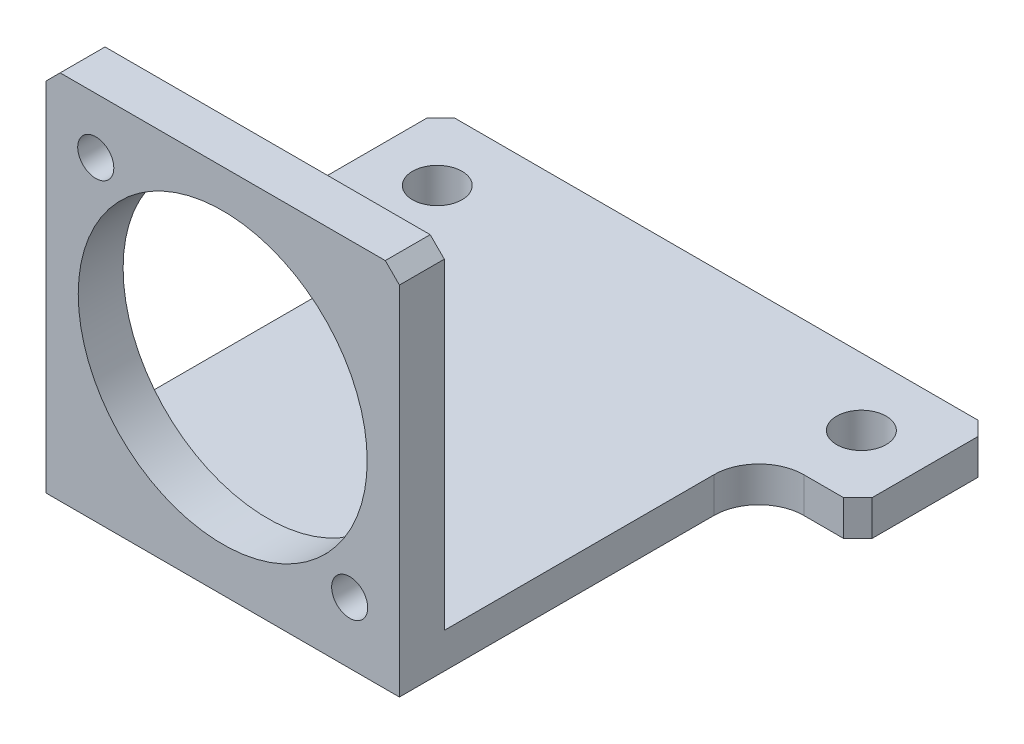
ISO-10303-21;
HEADER;
FILE_DESCRIPTION(('STEP AP214'),'2;1');
FILE_NAME('part.step','',(''),(''),'','','');
FILE_SCHEMA(('AUTOMOTIVE_DESIGN { 1 0 10303 214 1 1 1 1 }'));
ENDSEC;
DATA;
#1=APPLICATION_CONTEXT('core data for automotive mechanical design processes');
#2=APPLICATION_PROTOCOL_DEFINITION('international standard','automotive_design',2000,#1);
#3=PRODUCT_CONTEXT('',#1,'mechanical');
#4=PRODUCT('Part','Part','',(#3));
#5=PRODUCT_RELATED_PRODUCT_CATEGORY('part','',(#4));
#6=PRODUCT_DEFINITION_FORMATION('','',#4);
#7=PRODUCT_DEFINITION_CONTEXT('part definition',#1,'design');
#8=PRODUCT_DEFINITION('design','',#6,#7);
#9=PRODUCT_DEFINITION_SHAPE('','',#8);
#10=(LENGTH_UNIT() NAMED_UNIT(*) SI_UNIT(.MILLI.,.METRE.));
#11=(NAMED_UNIT(*) PLANE_ANGLE_UNIT() SI_UNIT($,.RADIAN.));
#12=(NAMED_UNIT(*) SI_UNIT($,.STERADIAN.) SOLID_ANGLE_UNIT());
#13=UNCERTAINTY_MEASURE_WITH_UNIT(LENGTH_MEASURE(1.E-05),#10,'distance_accuracy_value','');
#14=(GEOMETRIC_REPRESENTATION_CONTEXT(3) GLOBAL_UNCERTAINTY_ASSIGNED_CONTEXT((#13)) GLOBAL_UNIT_ASSIGNED_CONTEXT((#10,
#11,#12)) REPRESENTATION_CONTEXT('',''));
#15=CARTESIAN_POINT('',(0.,0.,0.));
#16=DIRECTION('',(0.,0.,1.));
#17=DIRECTION('',(1.,0.,0.));
#18=AXIS2_PLACEMENT_3D('',#15,#16,#17);
#19=CARTESIAN_POINT('',(0.,0.,6.35));
#20=DIRECTION('',(0.,0.,-1.));
#21=DIRECTION('',(-1.,0.,0.));
#22=AXIS2_PLACEMENT_3D('',#19,#20,#21);
#23=PLANE('',#22);
#24=CARTESIAN_POINT('',(-17.9605122421382,18.3755122421384,6.35));
#25=DIRECTION('',(0.,0.,1.));
#26=DIRECTION('',(1.,0.,0.));
#27=AXIS2_PLACEMENT_3D('',#24,#25,#26);
#28=CIRCLE('',#27,2.5527);
#29=CARTESIAN_POINT('',(-15.4078122421382,18.3755122421384,6.35));
#30=VERTEX_POINT('',#29);
#31=EDGE_CURVE('E429',#30,#30,#28,.T.);
#32=ORIENTED_EDGE('',*,*,#31,.F.);
#33=EDGE_LOOP('',(#32));
#34=FACE_BOUND('',#33,.T.);
#35=CARTESIAN_POINT('',(17.9605122421382,-17.5455122421384,6.35));
#36=DIRECTION('',(0.,0.,1.));
#37=DIRECTION('',(1.,0.,0.));
#38=AXIS2_PLACEMENT_3D('',#35,#36,#37);
#39=CIRCLE('',#38,2.5527);
#40=CARTESIAN_POINT('',(20.5132122421382,-17.5455122421384,6.35));
#41=VERTEX_POINT('',#40);
#42=EDGE_CURVE('E423',#41,#41,#39,.T.);
#43=ORIENTED_EDGE('',*,*,#42,.F.);
#44=EDGE_LOOP('',(#43));
#45=FACE_BOUND('',#44,.T.);
#46=DIRECTION('',(0.,1.,0.));
#47=VECTOR('',#46,1.);
#48=CARTESIAN_POINT('',(25.,-26.24,6.35));
#49=LINE('',#48,#47);
#50=CARTESIAN_POINT('',(25.,-26.24,6.35));
#51=VERTEX_POINT('',#50);
#52=CARTESIAN_POINT('',(25.,24.24,6.35));
#53=VERTEX_POINT('',#52);
#54=EDGE_CURVE('E237',#51,#53,#49,.T.);
#55=ORIENTED_EDGE('',*,*,#54,.T.);
#56=DIRECTION('',(0.707106781186548,-0.707106781186548,0.));
#57=VECTOR('',#56,1.);
#58=CARTESIAN_POINT('',(23.,26.24,6.35));
#59=LINE('',#58,#57);
#60=CARTESIAN_POINT('',(23.,26.24,6.35));
#61=VERTEX_POINT('',#60);
#62=EDGE_CURVE('E52',#53,#61,#59,.F.);
#63=ORIENTED_EDGE('',*,*,#62,.T.);
#64=DIRECTION('',(-1.,0.,0.));
#65=VECTOR('',#64,1.);
#66=CARTESIAN_POINT('',(-25.,26.24,6.35));
#67=LINE('',#66,#65);
#68=CARTESIAN_POINT('',(-23.,26.24,6.35));
#69=VERTEX_POINT('',#68);
#70=EDGE_CURVE('E239',#61,#69,#67,.T.);
#71=ORIENTED_EDGE('',*,*,#70,.T.);
#72=DIRECTION('',(0.707106781186548,0.707106781186548,0.));
#73=VECTOR('',#72,1.);
#74=CARTESIAN_POINT('',(-25.,24.24,6.35));
#75=LINE('',#74,#73);
#76=CARTESIAN_POINT('',(-25.,24.24,6.35));
#77=VERTEX_POINT('',#76);
#78=EDGE_CURVE('E59',#69,#77,#75,.F.);
#79=ORIENTED_EDGE('',*,*,#78,.T.);
#80=DIRECTION('',(0.,-1.,0.));
#81=VECTOR('',#80,1.);
#82=CARTESIAN_POINT('',(-25.,-26.24,6.35));
#83=LINE('',#82,#81);
#84=CARTESIAN_POINT('',(-25.,-26.24,6.35));
#85=VERTEX_POINT('',#84);
#86=EDGE_CURVE('E242',#77,#85,#83,.T.);
#87=ORIENTED_EDGE('',*,*,#86,.T.);
#88=DIRECTION('',(1.,0.,0.));
#89=VECTOR('',#88,1.);
#90=CARTESIAN_POINT('',(-25.,-26.24,6.35));
#91=LINE('',#90,#89);
#92=EDGE_CURVE('E244',#85,#51,#91,.T.);
#93=ORIENTED_EDGE('',*,*,#92,.T.);
#94=EDGE_LOOP('',(#55,#63,#71,#79,#87,#93));
#95=FACE_BOUND('',#94,.T.);
#96=CARTESIAN_POINT('',(0.,0.415000000000002,6.35));
#97=DIRECTION('',(0.,0.,1.));
#98=DIRECTION('',(1.,0.,0.));
#99=AXIS2_PLACEMENT_3D('',#96,#97,#98);
#100=CIRCLE('',#99,20.44);
#101=CARTESIAN_POINT('',(20.44,0.415000000000002,6.35));
#102=VERTEX_POINT('',#101);
#103=EDGE_CURVE('E181',#102,#102,#100,.T.);
#104=ORIENTED_EDGE('',*,*,#103,.F.);
#105=EDGE_LOOP('',(#104));
#106=FACE_BOUND('',#105,.T.);
#107=ADVANCED_FACE('F43',(#34,#45,#95,#106),#23,.F.);
#108=CARTESIAN_POINT('',(0.,0.,0.));
#109=DIRECTION('',(0.,0.,-1.));
#110=DIRECTION('',(-1.,0.,0.));
#111=AXIS2_PLACEMENT_3D('',#108,#109,#110);
#112=PLANE('',#111);
#113=CARTESIAN_POINT('',(-17.9605122421382,18.3755122421384,0.));
#114=DIRECTION('',(0.,0.,-1.));
#115=DIRECTION('',(-1.,0.,0.));
#116=AXIS2_PLACEMENT_3D('',#113,#114,#115);
#117=CIRCLE('',#116,2.5527);
#118=CARTESIAN_POINT('',(-20.5132122421382,18.3755122421384,0.));
#119=VERTEX_POINT('',#118);
#120=EDGE_CURVE('E426',#119,#119,#117,.T.);
#121=ORIENTED_EDGE('',*,*,#120,.F.);
#122=EDGE_LOOP('',(#121));
#123=FACE_BOUND('',#122,.T.);
#124=CARTESIAN_POINT('',(17.9605122421382,-17.5455122421384,0.));
#125=DIRECTION('',(0.,0.,-1.));
#126=DIRECTION('',(-1.,0.,0.));
#127=AXIS2_PLACEMENT_3D('',#124,#125,#126);
#128=CIRCLE('',#127,2.5527);
#129=CARTESIAN_POINT('',(15.4078122421382,-17.5455122421384,0.));
#130=VERTEX_POINT('',#129);
#131=EDGE_CURVE('E215',#130,#130,#128,.T.);
#132=ORIENTED_EDGE('',*,*,#131,.F.);
#133=EDGE_LOOP('',(#132));
#134=FACE_BOUND('',#133,.T.);
#135=DIRECTION('',(-1.,0.,0.));
#136=VECTOR('',#135,1.);
#137=CARTESIAN_POINT('',(-25.,26.24,0.));
#138=LINE('',#137,#136);
#139=CARTESIAN_POINT('',(23.,26.24,0.));
#140=VERTEX_POINT('',#139);
#141=CARTESIAN_POINT('',(-23.,26.24,0.));
#142=VERTEX_POINT('',#141);
#143=EDGE_CURVE('E180',#140,#142,#138,.T.);
#144=ORIENTED_EDGE('',*,*,#143,.F.);
#145=DIRECTION('',(-0.707106781186548,0.707106781186548,0.));
#146=VECTOR('',#145,1.);
#147=CARTESIAN_POINT('',(24.62,24.62,0.));
#148=LINE('',#147,#146);
#149=CARTESIAN_POINT('',(25.,24.24,0.));
#150=VERTEX_POINT('',#149);
#151=EDGE_CURVE('E178',#140,#150,#148,.F.);
#152=ORIENTED_EDGE('',*,*,#151,.T.);
#153=DIRECTION('',(0.,1.,0.));
#154=VECTOR('',#153,1.);
#155=CARTESIAN_POINT('',(25.,-26.24,0.));
#156=LINE('',#155,#154);
#157=CARTESIAN_POINT('',(25.,-21.24,0.));
#158=VERTEX_POINT('',#157);
#159=EDGE_CURVE('E171',#158,#150,#156,.T.);
#160=ORIENTED_EDGE('',*,*,#159,.F.);
#161=DIRECTION('',(1.,0.,0.));
#162=VECTOR('',#161,1.);
#163=CARTESIAN_POINT('',(0.,-21.24,0.));
#164=LINE('',#163,#162);
#165=CARTESIAN_POINT('',(-25.,-21.24,0.));
#166=VERTEX_POINT('',#165);
#167=EDGE_CURVE('E177',#166,#158,#164,.T.);
#168=ORIENTED_EDGE('',*,*,#167,.F.);
#169=DIRECTION('',(0.,-1.,0.));
#170=VECTOR('',#169,1.);
#171=CARTESIAN_POINT('',(-25.,-26.24,0.));
#172=LINE('',#171,#170);
#173=CARTESIAN_POINT('',(-25.,24.24,0.));
#174=VERTEX_POINT('',#173);
#175=EDGE_CURVE('E240',#174,#166,#172,.T.);
#176=ORIENTED_EDGE('',*,*,#175,.F.);
#177=DIRECTION('',(-0.707106781186548,-0.707106781186548,0.));
#178=VECTOR('',#177,1.);
#179=CARTESIAN_POINT('',(-24.62,24.62,0.));
#180=LINE('',#179,#178);
#181=EDGE_CURVE('E314',#174,#142,#180,.F.);
#182=ORIENTED_EDGE('',*,*,#181,.T.);
#183=EDGE_LOOP('',(#144,#152,#160,#168,#176,#182));
#184=FACE_BOUND('',#183,.T.);
#185=CARTESIAN_POINT('',(0.,0.415000000000002,0.));
#186=DIRECTION('',(0.,0.,1.));
#187=DIRECTION('',(1.,0.,0.));
#188=AXIS2_PLACEMENT_3D('',#185,#186,#187);
#189=CIRCLE('',#188,20.44);
#190=CARTESIAN_POINT('',(20.44,0.415000000000002,0.));
#191=VERTEX_POINT('',#190);
#192=EDGE_CURVE('E211',#191,#191,#189,.T.);
#193=ORIENTED_EDGE('',*,*,#192,.T.);
#194=EDGE_LOOP('',(#193));
#195=FACE_BOUND('',#194,.T.);
#196=ADVANCED_FACE('F174',(#123,#134,#184,#195),#112,.T.);
#197=CARTESIAN_POINT('',(25.,-26.24,6.35));
#198=DIRECTION('',(-1.,0.,0.));
#199=DIRECTION('',(0.,0.,1.));
#200=AXIS2_PLACEMENT_3D('',#197,#198,#199);
#201=PLANE('',#200);
#202=ORIENTED_EDGE('',*,*,#159,.T.);
#203=DIRECTION('',(0.,0.,1.));
#204=VECTOR('',#203,1.);
#205=CARTESIAN_POINT('',(25.,24.24,6.35));
#206=LINE('',#205,#204);
#207=EDGE_CURVE('E67',#150,#53,#206,.T.);
#208=ORIENTED_EDGE('',*,*,#207,.T.);
#209=ORIENTED_EDGE('',*,*,#54,.F.);
#210=DIRECTION('',(0.,0.,-1.));
#211=VECTOR('',#210,1.);
#212=CARTESIAN_POINT('',(25.,-26.24,6.35));
#213=LINE('',#212,#211);
#214=CARTESIAN_POINT('',(25.,-26.24,-38.15));
#215=VERTEX_POINT('',#214);
#216=EDGE_CURVE('E245',#51,#215,#213,.T.);
#217=ORIENTED_EDGE('',*,*,#216,.T.);
#218=DIRECTION('',(0.,-1.,0.));
#219=VECTOR('',#218,1.);
#220=CARTESIAN_POINT('',(25.,-21.24,-38.15));
#221=LINE('',#220,#219);
#222=CARTESIAN_POINT('',(25.,-21.24,-38.15));
#223=VERTEX_POINT('',#222);
#224=EDGE_CURVE('E198',#215,#223,#221,.F.);
#225=ORIENTED_EDGE('',*,*,#224,.T.);
#226=DIRECTION('',(0.,0.,-1.));
#227=VECTOR('',#226,1.);
#228=CARTESIAN_POINT('',(25.,-21.24,0.));
#229=LINE('',#228,#227);
#230=EDGE_CURVE('E189',#158,#223,#229,.T.);
#231=ORIENTED_EDGE('',*,*,#230,.F.);
#232=EDGE_LOOP('',(#202,#208,#209,#217,#225,#231));
#233=FACE_BOUND('',#232,.T.);
#234=ADVANCED_FACE('F195',(#233),#201,.F.);
#235=CARTESIAN_POINT('',(-25.,26.24,6.35));
#236=DIRECTION('',(0.,-1.,0.));
#237=DIRECTION('',(0.,0.,-1.));
#238=AXIS2_PLACEMENT_3D('',#235,#236,#237);
#239=PLANE('',#238);
#240=ORIENTED_EDGE('',*,*,#70,.F.);
#241=DIRECTION('',(0.,0.,-1.));
#242=VECTOR('',#241,1.);
#243=CARTESIAN_POINT('',(23.,26.24,6.35));
#244=LINE('',#243,#242);
#245=EDGE_CURVE('E311',#61,#140,#244,.T.);
#246=ORIENTED_EDGE('',*,*,#245,.T.);
#247=ORIENTED_EDGE('',*,*,#143,.T.);
#248=DIRECTION('',(0.,0.,1.));
#249=VECTOR('',#248,1.);
#250=CARTESIAN_POINT('',(-23.,26.24,6.35));
#251=LINE('',#250,#249);
#252=EDGE_CURVE('E309',#142,#69,#251,.T.);
#253=ORIENTED_EDGE('',*,*,#252,.T.);
#254=EDGE_LOOP('',(#240,#246,#247,#253));
#255=FACE_BOUND('',#254,.T.);
#256=ADVANCED_FACE('F324',(#255),#239,.F.);
#257=CARTESIAN_POINT('',(-25.,-26.24,6.35));
#258=DIRECTION('',(1.,0.,0.));
#259=DIRECTION('',(0.,0.,-1.));
#260=AXIS2_PLACEMENT_3D('',#257,#258,#259);
#261=PLANE('',#260);
#262=ORIENTED_EDGE('',*,*,#86,.F.);
#263=DIRECTION('',(0.,0.,-1.));
#264=VECTOR('',#263,1.);
#265=CARTESIAN_POINT('',(-25.,24.24,6.35));
#266=LINE('',#265,#264);
#267=EDGE_CURVE('E11',#77,#174,#266,.T.);
#268=ORIENTED_EDGE('',*,*,#267,.T.);
#269=ORIENTED_EDGE('',*,*,#175,.T.);
#270=DIRECTION('',(0.,0.,1.));
#271=VECTOR('',#270,1.);
#272=CARTESIAN_POINT('',(-25.,-21.24,0.));
#273=LINE('',#272,#271);
#274=CARTESIAN_POINT('',(-25.,-21.24,-38.15));
#275=VERTEX_POINT('',#274);
#276=EDGE_CURVE('E192',#275,#166,#273,.T.);
#277=ORIENTED_EDGE('',*,*,#276,.F.);
#278=DIRECTION('',(0.,-1.,0.));
#279=VECTOR('',#278,1.);
#280=CARTESIAN_POINT('',(-25.,-26.24,-38.15));
#281=LINE('',#280,#279);
#282=CARTESIAN_POINT('',(-25.,-26.24,-38.15));
#283=VERTEX_POINT('',#282);
#284=EDGE_CURVE('E258',#275,#283,#281,.T.);
#285=ORIENTED_EDGE('',*,*,#284,.T.);
#286=DIRECTION('',(0.,0.,-1.));
#287=VECTOR('',#286,1.);
#288=CARTESIAN_POINT('',(-25.,-26.24,6.35));
#289=LINE('',#288,#287);
#290=EDGE_CURVE('E251',#85,#283,#289,.T.);
#291=ORIENTED_EDGE('',*,*,#290,.F.);
#292=EDGE_LOOP('',(#262,#268,#269,#277,#285,#291));
#293=FACE_BOUND('',#292,.T.);
#294=ADVANCED_FACE('F355',(#293),#261,.F.);
#295=CARTESIAN_POINT('',(-25.,-26.24,6.35));
#296=DIRECTION('',(0.,1.,0.));
#297=DIRECTION('',(0.,0.,1.));
#298=AXIS2_PLACEMENT_3D('',#295,#296,#297);
#299=PLANE('',#298);
#300=DIRECTION('',(0.,0.,1.));
#301=VECTOR('',#300,1.);
#302=CARTESIAN_POINT('',(-39.,-26.24,0.));
#303=LINE('',#302,#301);
#304=CARTESIAN_POINT('',(-39.,-26.24,-61.5));
#305=VERTEX_POINT('',#304);
#306=CARTESIAN_POINT('',(-39.,-26.24,-46.5));
#307=VERTEX_POINT('',#306);
#308=EDGE_CURVE('E214',#305,#307,#303,.T.);
#309=ORIENTED_EDGE('',*,*,#308,.F.);
#310=DIRECTION('',(-0.70710678118655,0.,0.707106781186545));
#311=VECTOR('',#310,1.);
#312=CARTESIAN_POINT('',(-39.,-26.24,-61.5));
#313=LINE('',#312,#311);
#314=CARTESIAN_POINT('',(-37.,-26.24,-63.5));
#315=VERTEX_POINT('',#314);
#316=EDGE_CURVE('E284',#305,#315,#313,.F.);
#317=ORIENTED_EDGE('',*,*,#316,.T.);
#318=DIRECTION('',(-1.,0.,0.));
#319=VECTOR('',#318,1.);
#320=CARTESIAN_POINT('',(0.,-26.24,-63.5));
#321=LINE('',#320,#319);
#322=CARTESIAN_POINT('',(37.,-26.24,-63.5));
#323=VERTEX_POINT('',#322);
#324=EDGE_CURVE('E218',#323,#315,#321,.T.);
#325=ORIENTED_EDGE('',*,*,#324,.F.);
#326=DIRECTION('',(-0.707106781186548,0.,-0.707106781186548));
#327=VECTOR('',#326,1.);
#328=CARTESIAN_POINT('',(37.,-26.24,-63.5));
#329=LINE('',#328,#327);
#330=CARTESIAN_POINT('',(39.,-26.24,-61.5));
#331=VERTEX_POINT('',#330);
#332=EDGE_CURVE('E280',#323,#331,#329,.F.);
#333=ORIENTED_EDGE('',*,*,#332,.T.);
#334=DIRECTION('',(0.,0.,-1.));
#335=VECTOR('',#334,1.);
#336=CARTESIAN_POINT('',(39.,-26.24,0.));
#337=LINE('',#336,#335);
#338=CARTESIAN_POINT('',(39.,-26.24,-46.5));
#339=VERTEX_POINT('',#338);
#340=EDGE_CURVE('E221',#339,#331,#337,.T.);
#341=ORIENTED_EDGE('',*,*,#340,.F.);
#342=DIRECTION('',(0.707106781186548,0.,-0.707106781186548));
#343=VECTOR('',#342,1.);
#344=CARTESIAN_POINT('',(39.,-26.24,-46.5));
#345=LINE('',#344,#343);
#346=CARTESIAN_POINT('',(37.,-26.24,-44.5));
#347=VERTEX_POINT('',#346);
#348=EDGE_CURVE('E278',#339,#347,#345,.F.);
#349=ORIENTED_EDGE('',*,*,#348,.T.);
#350=DIRECTION('',(1.,0.,0.));
#351=VECTOR('',#350,1.);
#352=CARTESIAN_POINT('',(0.,-26.24,-44.5));
#353=LINE('',#352,#351);
#354=CARTESIAN_POINT('',(31.35,-26.24,-44.5));
#355=VERTEX_POINT('',#354);
#356=EDGE_CURVE('E224',#355,#347,#353,.T.);
#357=ORIENTED_EDGE('',*,*,#356,.F.);
#358=CARTESIAN_POINT('',(31.35,-26.24,-38.15));
#359=DIRECTION('',(0.,1.,0.));
#360=DIRECTION('',(0.,0.,1.));
#361=AXIS2_PLACEMENT_3D('',#358,#359,#360);
#362=CIRCLE('',#361,6.35);
#363=EDGE_CURVE('E264',#355,#215,#362,.T.);
#364=ORIENTED_EDGE('',*,*,#363,.T.);
#365=ORIENTED_EDGE('',*,*,#216,.F.);
#366=ORIENTED_EDGE('',*,*,#92,.F.);
#367=ORIENTED_EDGE('',*,*,#290,.T.);
#368=CARTESIAN_POINT('',(-31.35,-26.24,-38.15));
#369=DIRECTION('',(0.,1.,0.));
#370=DIRECTION('',(0.,0.,1.));
#371=AXIS2_PLACEMENT_3D('',#368,#369,#370);
#372=CIRCLE('',#371,6.35);
#373=CARTESIAN_POINT('',(-31.35,-26.24,-44.5));
#374=VERTEX_POINT('',#373);
#375=EDGE_CURVE('E268',#283,#374,#372,.T.);
#376=ORIENTED_EDGE('',*,*,#375,.T.);
#377=DIRECTION('',(1.,0.,0.));
#378=VECTOR('',#377,1.);
#379=CARTESIAN_POINT('',(0.,-26.24,-44.5));
#380=LINE('',#379,#378);
#381=CARTESIAN_POINT('',(-37.,-26.24,-44.5));
#382=VERTEX_POINT('',#381);
#383=EDGE_CURVE('E212',#382,#374,#380,.T.);
#384=ORIENTED_EDGE('',*,*,#383,.F.);
#385=DIRECTION('',(0.707106781186548,0.,0.707106781186548));
#386=VECTOR('',#385,1.);
#387=CARTESIAN_POINT('',(-37.,-26.24,-44.5));
#388=LINE('',#387,#386);
#389=EDGE_CURVE('E282',#382,#307,#388,.F.);
#390=ORIENTED_EDGE('',*,*,#389,.T.);
#391=EDGE_LOOP('',(#309,#317,#325,#333,#341,#349,#357,#364,#365,#366,#367,#376,#384,#390));
#392=FACE_BOUND('',#391,.T.);
#393=CARTESIAN_POINT('',(30.,-26.24,-54.));
#394=DIRECTION('',(0.,-1.,0.));
#395=DIRECTION('',(0.,0.,-1.));
#396=AXIS2_PLACEMENT_3D('',#393,#394,#395);
#397=CIRCLE('',#396,3.49999999999999);
#398=CARTESIAN_POINT('',(30.,-26.24,-57.5));
#399=VERTEX_POINT('',#398);
#400=EDGE_CURVE('E227',#399,#399,#397,.T.);
#401=ORIENTED_EDGE('',*,*,#400,.F.);
#402=EDGE_LOOP('',(#401));
#403=FACE_BOUND('',#402,.T.);
#404=CARTESIAN_POINT('',(-30.,-26.24,-54.));
#405=DIRECTION('',(0.,-1.,0.));
#406=DIRECTION('',(0.,0.,-1.));
#407=AXIS2_PLACEMENT_3D('',#404,#405,#406);
#408=CIRCLE('',#407,3.5);
#409=CARTESIAN_POINT('',(-30.,-26.24,-57.5));
#410=VERTEX_POINT('',#409);
#411=EDGE_CURVE('E230',#410,#410,#408,.T.);
#412=ORIENTED_EDGE('',*,*,#411,.F.);
#413=EDGE_LOOP('',(#412));
#414=FACE_BOUND('',#413,.T.);
#415=ADVANCED_FACE('F352',(#392,#403,#414),#299,.F.);
#416=CARTESIAN_POINT('',(0.,0.415000000000002,6.35));
#417=DIRECTION('',(0.,0.,-1.));
#418=DIRECTION('',(-1.,0.,0.));
#419=AXIS2_PLACEMENT_3D('',#416,#417,#418);
#420=CYLINDRICAL_SURFACE('',#419,20.44);
#421=ORIENTED_EDGE('',*,*,#103,.T.);
#422=EDGE_LOOP('',(#421));
#423=FACE_BOUND('',#422,.T.);
#424=ORIENTED_EDGE('',*,*,#192,.F.);
#425=EDGE_LOOP('',(#424));
#426=FACE_BOUND('',#425,.T.);
#427=ADVANCED_FACE('F349',(#423,#426),#420,.F.);
#428=CARTESIAN_POINT('',(0.,-21.24,-44.5));
#429=DIRECTION('',(0.,0.,-1.));
#430=DIRECTION('',(-1.,0.,0.));
#431=AXIS2_PLACEMENT_3D('',#428,#429,#430);
#432=PLANE('',#431);
#433=ORIENTED_EDGE('',*,*,#356,.T.);
#434=DIRECTION('',(0.,1.,0.));
#435=VECTOR('',#434,1.);
#436=CARTESIAN_POINT('',(37.,-21.24,-44.5));
#437=LINE('',#436,#435);
#438=CARTESIAN_POINT('',(37.,-21.24,-44.5));
#439=VERTEX_POINT('',#438);
#440=EDGE_CURVE('E307',#347,#439,#437,.T.);
#441=ORIENTED_EDGE('',*,*,#440,.T.);
#442=DIRECTION('',(1.,0.,0.));
#443=VECTOR('',#442,1.);
#444=CARTESIAN_POINT('',(0.,-21.24,-44.5));
#445=LINE('',#444,#443);
#446=CARTESIAN_POINT('',(31.35,-21.24,-44.5));
#447=VERTEX_POINT('',#446);
#448=EDGE_CURVE('E199',#447,#439,#445,.T.);
#449=ORIENTED_EDGE('',*,*,#448,.F.);
#450=DIRECTION('',(0.,-1.,0.));
#451=VECTOR('',#450,1.);
#452=CARTESIAN_POINT('',(31.35,-26.24,-44.5));
#453=LINE('',#452,#451);
#454=EDGE_CURVE('E254',#447,#355,#453,.T.);
#455=ORIENTED_EDGE('',*,*,#454,.T.);
#456=EDGE_LOOP('',(#433,#441,#449,#455));
#457=FACE_BOUND('',#456,.T.);
#458=ADVANCED_FACE('F458',(#457),#432,.F.);
#459=CARTESIAN_POINT('',(39.,-21.24,0.));
#460=DIRECTION('',(-1.,0.,0.));
#461=DIRECTION('',(0.,0.,1.));
#462=AXIS2_PLACEMENT_3D('',#459,#460,#461);
#463=PLANE('',#462);
#464=ORIENTED_EDGE('',*,*,#340,.T.);
#465=DIRECTION('',(0.,1.,0.));
#466=VECTOR('',#465,1.);
#467=CARTESIAN_POINT('',(39.,-21.24,-61.5));
#468=LINE('',#467,#466);
#469=CARTESIAN_POINT('',(39.,-21.24,-61.5));
#470=VERTEX_POINT('',#469);
#471=EDGE_CURVE('E305',#331,#470,#468,.T.);
#472=ORIENTED_EDGE('',*,*,#471,.T.);
#473=DIRECTION('',(0.,0.,-1.));
#474=VECTOR('',#473,1.);
#475=CARTESIAN_POINT('',(39.,-21.24,0.));
#476=LINE('',#475,#474);
#477=CARTESIAN_POINT('',(39.,-21.24,-46.5));
#478=VERTEX_POINT('',#477);
#479=EDGE_CURVE('E202',#478,#470,#476,.T.);
#480=ORIENTED_EDGE('',*,*,#479,.F.);
#481=DIRECTION('',(0.,-1.,0.));
#482=VECTOR('',#481,1.);
#483=CARTESIAN_POINT('',(39.,-21.24,-46.5));
#484=LINE('',#483,#482);
#485=EDGE_CURVE('E302',#478,#339,#484,.T.);
#486=ORIENTED_EDGE('',*,*,#485,.T.);
#487=EDGE_LOOP('',(#464,#472,#480,#486));
#488=FACE_BOUND('',#487,.T.);
#489=ADVANCED_FACE('F461',(#488),#463,.F.);
#490=CARTESIAN_POINT('',(0.,-21.24,-63.5));
#491=DIRECTION('',(0.,0.,1.));
#492=DIRECTION('',(1.,0.,0.));
#493=AXIS2_PLACEMENT_3D('',#490,#491,#492);
#494=PLANE('',#493);
#495=ORIENTED_EDGE('',*,*,#324,.T.);
#496=DIRECTION('',(0.,1.,0.));
#497=VECTOR('',#496,1.);
#498=CARTESIAN_POINT('',(-37.,-21.24,-63.5));
#499=LINE('',#498,#497);
#500=CARTESIAN_POINT('',(-37.,-21.24,-63.5));
#501=VERTEX_POINT('',#500);
#502=EDGE_CURVE('E289',#315,#501,#499,.T.);
#503=ORIENTED_EDGE('',*,*,#502,.T.);
#504=DIRECTION('',(-1.,0.,0.));
#505=VECTOR('',#504,1.);
#506=CARTESIAN_POINT('',(0.,-21.24,-63.5));
#507=LINE('',#506,#505);
#508=CARTESIAN_POINT('',(37.,-21.24,-63.5));
#509=VERTEX_POINT('',#508);
#510=EDGE_CURVE('E406',#509,#501,#507,.T.);
#511=ORIENTED_EDGE('',*,*,#510,.F.);
#512=DIRECTION('',(0.,-1.,0.));
#513=VECTOR('',#512,1.);
#514=CARTESIAN_POINT('',(37.,-21.24,-63.5));
#515=LINE('',#514,#513);
#516=EDGE_CURVE('E286',#509,#323,#515,.T.);
#517=ORIENTED_EDGE('',*,*,#516,.T.);
#518=EDGE_LOOP('',(#495,#503,#511,#517));
#519=FACE_BOUND('',#518,.T.);
#520=ADVANCED_FACE('F410',(#519),#494,.F.);
#521=CARTESIAN_POINT('',(-39.,-21.24,0.));
#522=DIRECTION('',(1.,0.,0.));
#523=DIRECTION('',(0.,0.,-1.));
#524=AXIS2_PLACEMENT_3D('',#521,#522,#523);
#525=PLANE('',#524);
#526=DIRECTION('',(0.,0.,1.));
#527=VECTOR('',#526,1.);
#528=CARTESIAN_POINT('',(-39.,-21.24,0.));
#529=LINE('',#528,#527);
#530=CARTESIAN_POINT('',(-39.,-21.24,-61.5));
#531=VERTEX_POINT('',#530);
#532=CARTESIAN_POINT('',(-39.,-21.24,-46.5));
#533=VERTEX_POINT('',#532);
#534=EDGE_CURVE('E413',#531,#533,#529,.T.);
#535=ORIENTED_EDGE('',*,*,#534,.F.);
#536=DIRECTION('',(0.,-1.,0.));
#537=VECTOR('',#536,1.);
#538=CARTESIAN_POINT('',(-39.,-21.24,-61.5));
#539=LINE('',#538,#537);
#540=EDGE_CURVE('E275',#531,#305,#539,.T.);
#541=ORIENTED_EDGE('',*,*,#540,.T.);
#542=ORIENTED_EDGE('',*,*,#308,.T.);
#543=DIRECTION('',(0.,1.,0.));
#544=VECTOR('',#543,1.);
#545=CARTESIAN_POINT('',(-39.,-21.24,-46.5));
#546=LINE('',#545,#544);
#547=EDGE_CURVE('E273',#307,#533,#546,.T.);
#548=ORIENTED_EDGE('',*,*,#547,.T.);
#549=EDGE_LOOP('',(#535,#541,#542,#548));
#550=FACE_BOUND('',#549,.T.);
#551=ADVANCED_FACE('F456',(#550),#525,.F.);
#552=CARTESIAN_POINT('',(30.,-21.24,-54.));
#553=DIRECTION('',(0.,-1.,0.));
#554=DIRECTION('',(0.,0.,-1.));
#555=AXIS2_PLACEMENT_3D('',#552,#553,#554);
#556=CYLINDRICAL_SURFACE('',#555,3.49999999999999);
#557=CARTESIAN_POINT('',(30.,-21.24,-54.));
#558=DIRECTION('',(0.,-1.,0.));
#559=DIRECTION('',(0.,0.,-1.));
#560=AXIS2_PLACEMENT_3D('',#557,#558,#559);
#561=CIRCLE('',#560,3.49999999999999);
#562=CARTESIAN_POINT('',(30.,-21.24,-57.5));
#563=VERTEX_POINT('',#562);
#564=EDGE_CURVE('E193',#563,#563,#561,.T.);
#565=ORIENTED_EDGE('',*,*,#564,.F.);
#566=EDGE_LOOP('',(#565));
#567=FACE_BOUND('',#566,.T.);
#568=ORIENTED_EDGE('',*,*,#400,.T.);
#569=EDGE_LOOP('',(#568));
#570=FACE_BOUND('',#569,.T.);
#571=ADVANCED_FACE('F453',(#567,#570),#556,.F.);
#572=CARTESIAN_POINT('',(0.,-21.24,-44.5));
#573=DIRECTION('',(0.,0.,-1.));
#574=DIRECTION('',(-1.,0.,0.));
#575=AXIS2_PLACEMENT_3D('',#572,#573,#574);
#576=PLANE('',#575);
#577=DIRECTION('',(1.,0.,0.));
#578=VECTOR('',#577,1.);
#579=CARTESIAN_POINT('',(0.,-21.24,-44.5));
#580=LINE('',#579,#578);
#581=CARTESIAN_POINT('',(-37.,-21.24,-44.5));
#582=VERTEX_POINT('',#581);
#583=CARTESIAN_POINT('',(-31.35,-21.24,-44.5));
#584=VERTEX_POINT('',#583);
#585=EDGE_CURVE('E416',#582,#584,#580,.T.);
#586=ORIENTED_EDGE('',*,*,#585,.F.);
#587=DIRECTION('',(0.,-1.,0.));
#588=VECTOR('',#587,1.);
#589=CARTESIAN_POINT('',(-37.,-21.24,-44.5));
#590=LINE('',#589,#588);
#591=EDGE_CURVE('E299',#582,#382,#590,.T.);
#592=ORIENTED_EDGE('',*,*,#591,.T.);
#593=ORIENTED_EDGE('',*,*,#383,.T.);
#594=DIRECTION('',(0.,-1.,0.));
#595=VECTOR('',#594,1.);
#596=CARTESIAN_POINT('',(-31.35,-21.24,-44.5));
#597=LINE('',#596,#595);
#598=EDGE_CURVE('E261',#374,#584,#597,.F.);
#599=ORIENTED_EDGE('',*,*,#598,.T.);
#600=EDGE_LOOP('',(#586,#592,#593,#599));
#601=FACE_BOUND('',#600,.T.);
#602=ADVANCED_FACE('F451',(#601),#576,.F.);
#603=CARTESIAN_POINT('',(-30.,-21.24,-54.));
#604=DIRECTION('',(0.,-1.,0.));
#605=DIRECTION('',(0.,0.,-1.));
#606=AXIS2_PLACEMENT_3D('',#603,#604,#605);
#607=CYLINDRICAL_SURFACE('',#606,3.5);
#608=CARTESIAN_POINT('',(-30.,-21.24,-54.));
#609=DIRECTION('',(0.,-1.,0.));
#610=DIRECTION('',(0.,0.,-1.));
#611=AXIS2_PLACEMENT_3D('',#608,#609,#610);
#612=CIRCLE('',#611,3.5);
#613=CARTESIAN_POINT('',(-30.,-21.24,-57.5));
#614=VERTEX_POINT('',#613);
#615=EDGE_CURVE('E208',#614,#614,#612,.T.);
#616=ORIENTED_EDGE('',*,*,#615,.F.);
#617=EDGE_LOOP('',(#616));
#618=FACE_BOUND('',#617,.T.);
#619=ORIENTED_EDGE('',*,*,#411,.T.);
#620=EDGE_LOOP('',(#619));
#621=FACE_BOUND('',#620,.T.);
#622=ADVANCED_FACE('F446',(#618,#621),#607,.F.);
#623=CARTESIAN_POINT('',(0.,-21.24,0.));
#624=DIRECTION('',(0.,-1.,0.));
#625=DIRECTION('',(0.,0.,-1.));
#626=AXIS2_PLACEMENT_3D('',#623,#624,#625);
#627=PLANE('',#626);
#628=ORIENTED_EDGE('',*,*,#510,.T.);
#629=DIRECTION('',(0.70710678118655,0.,-0.707106781186545));
#630=VECTOR('',#629,1.);
#631=CARTESIAN_POINT('',(-39.,-21.24,-61.5));
#632=LINE('',#631,#630);
#633=EDGE_CURVE('E297',#501,#531,#632,.F.);
#634=ORIENTED_EDGE('',*,*,#633,.T.);
#635=ORIENTED_EDGE('',*,*,#534,.T.);
#636=DIRECTION('',(-0.707106781186548,0.,-0.707106781186548));
#637=VECTOR('',#636,1.);
#638=CARTESIAN_POINT('',(-37.,-21.24,-44.5));
#639=LINE('',#638,#637);
#640=EDGE_CURVE('E295',#533,#582,#639,.F.);
#641=ORIENTED_EDGE('',*,*,#640,.T.);
#642=ORIENTED_EDGE('',*,*,#585,.T.);
#643=CARTESIAN_POINT('',(-31.35,-21.24,-38.15));
#644=DIRECTION('',(0.,-1.,0.));
#645=DIRECTION('',(0.,0.,-1.));
#646=AXIS2_PLACEMENT_3D('',#643,#644,#645);
#647=CIRCLE('',#646,6.35);
#648=EDGE_CURVE('E271',#584,#275,#647,.T.);
#649=ORIENTED_EDGE('',*,*,#648,.T.);
#650=ORIENTED_EDGE('',*,*,#276,.T.);
#651=ORIENTED_EDGE('',*,*,#167,.T.);
#652=ORIENTED_EDGE('',*,*,#230,.T.);
#653=CARTESIAN_POINT('',(31.35,-21.24,-38.15));
#654=DIRECTION('',(0.,-1.,0.));
#655=DIRECTION('',(0.,0.,-1.));
#656=AXIS2_PLACEMENT_3D('',#653,#654,#655);
#657=CIRCLE('',#656,6.35);
#658=EDGE_CURVE('E266',#223,#447,#657,.T.);
#659=ORIENTED_EDGE('',*,*,#658,.T.);
#660=ORIENTED_EDGE('',*,*,#448,.T.);
#661=DIRECTION('',(-0.707106781186548,0.,0.707106781186548));
#662=VECTOR('',#661,1.);
#663=CARTESIAN_POINT('',(39.,-21.24,-46.5));
#664=LINE('',#663,#662);
#665=EDGE_CURVE('E291',#439,#478,#664,.F.);
#666=ORIENTED_EDGE('',*,*,#665,.T.);
#667=ORIENTED_EDGE('',*,*,#479,.T.);
#668=DIRECTION('',(0.707106781186548,0.,0.707106781186548));
#669=VECTOR('',#668,1.);
#670=CARTESIAN_POINT('',(37.,-21.24,-63.5));
#671=LINE('',#670,#669);
#672=EDGE_CURVE('E293',#470,#509,#671,.F.);
#673=ORIENTED_EDGE('',*,*,#672,.T.);
#674=EDGE_LOOP('',(#628,#634,#635,#641,#642,#649,#650,#651,#652,#659,#660,#666,#667,#673));
#675=FACE_BOUND('',#674,.T.);
#676=ORIENTED_EDGE('',*,*,#564,.T.);
#677=EDGE_LOOP('',(#676));
#678=FACE_BOUND('',#677,.T.);
#679=ORIENTED_EDGE('',*,*,#615,.T.);
#680=EDGE_LOOP('',(#679));
#681=FACE_BOUND('',#680,.T.);
#682=ADVANCED_FACE('F187',(#675,#678,#681),#627,.F.);
#683=CARTESIAN_POINT('',(17.9605122421382,-17.5455122421384,6.35));
#684=DIRECTION('',(0.,0.,1.));
#685=DIRECTION('',(1.,0.,0.));
#686=AXIS2_PLACEMENT_3D('',#683,#684,#685);
#687=CYLINDRICAL_SURFACE('',#686,2.5527);
#688=ORIENTED_EDGE('',*,*,#42,.T.);
#689=EDGE_LOOP('',(#688));
#690=FACE_BOUND('',#689,.T.);
#691=ORIENTED_EDGE('',*,*,#131,.T.);
#692=EDGE_LOOP('',(#691));
#693=FACE_BOUND('',#692,.T.);
#694=ADVANCED_FACE('F434',(#690,#693),#687,.F.);
#695=CARTESIAN_POINT('',(-17.9605122421382,18.3755122421384,6.35));
#696=DIRECTION('',(0.,0.,1.));
#697=DIRECTION('',(1.,0.,0.));
#698=AXIS2_PLACEMENT_3D('',#695,#696,#697);
#699=CYLINDRICAL_SURFACE('',#698,2.5527);
#700=ORIENTED_EDGE('',*,*,#31,.T.);
#701=EDGE_LOOP('',(#700));
#702=FACE_BOUND('',#701,.T.);
#703=ORIENTED_EDGE('',*,*,#120,.T.);
#704=EDGE_LOOP('',(#703));
#705=FACE_BOUND('',#704,.T.);
#706=ADVANCED_FACE('F368',(#702,#705),#699,.F.);
#707=CARTESIAN_POINT('',(31.35,-21.24,-38.15));
#708=DIRECTION('',(0.,1.,0.));
#709=DIRECTION('',(0.,0.,1.));
#710=AXIS2_PLACEMENT_3D('',#707,#708,#709);
#711=CYLINDRICAL_SURFACE('',#710,6.35);
#712=ORIENTED_EDGE('',*,*,#658,.F.);
#713=ORIENTED_EDGE('',*,*,#224,.F.);
#714=ORIENTED_EDGE('',*,*,#363,.F.);
#715=ORIENTED_EDGE('',*,*,#454,.F.);
#716=EDGE_LOOP('',(#712,#713,#714,#715));
#717=FACE_BOUND('',#716,.T.);
#718=ADVANCED_FACE('F364',(#717),#711,.F.);
#719=CARTESIAN_POINT('',(-31.35,-26.24,-38.15));
#720=DIRECTION('',(0.,1.,0.));
#721=DIRECTION('',(0.,0.,1.));
#722=AXIS2_PLACEMENT_3D('',#719,#720,#721);
#723=CYLINDRICAL_SURFACE('',#722,6.35);
#724=ORIENTED_EDGE('',*,*,#648,.F.);
#725=ORIENTED_EDGE('',*,*,#598,.F.);
#726=ORIENTED_EDGE('',*,*,#375,.F.);
#727=ORIENTED_EDGE('',*,*,#284,.F.);
#728=EDGE_LOOP('',(#724,#725,#726,#727));
#729=FACE_BOUND('',#728,.T.);
#730=ADVANCED_FACE('F367',(#729),#723,.F.);
#731=CARTESIAN_POINT('',(-39.,-21.24,-61.5));
#732=DIRECTION('',(0.707106781186545,0.,0.70710678118655));
#733=DIRECTION('',(0.,-1.,0.));
#734=AXIS2_PLACEMENT_3D('',#731,#732,#733);
#735=PLANE('',#734);
#736=ORIENTED_EDGE('',*,*,#633,.F.);
#737=ORIENTED_EDGE('',*,*,#502,.F.);
#738=ORIENTED_EDGE('',*,*,#316,.F.);
#739=ORIENTED_EDGE('',*,*,#540,.F.);
#740=EDGE_LOOP('',(#736,#737,#738,#739));
#741=FACE_BOUND('',#740,.T.);
#742=ADVANCED_FACE('F372',(#741),#735,.F.);
#743=CARTESIAN_POINT('',(-37.,-21.24,-44.5));
#744=DIRECTION('',(0.707106781186547,0.,-0.707106781186547));
#745=DIRECTION('',(0.,-1.,0.));
#746=AXIS2_PLACEMENT_3D('',#743,#744,#745);
#747=PLANE('',#746);
#748=ORIENTED_EDGE('',*,*,#640,.F.);
#749=ORIENTED_EDGE('',*,*,#547,.F.);
#750=ORIENTED_EDGE('',*,*,#389,.F.);
#751=ORIENTED_EDGE('',*,*,#591,.F.);
#752=EDGE_LOOP('',(#748,#749,#750,#751));
#753=FACE_BOUND('',#752,.T.);
#754=ADVANCED_FACE('F380',(#753),#747,.F.);
#755=CARTESIAN_POINT('',(37.,-21.24,-63.5));
#756=DIRECTION('',(-0.707106781186547,0.,0.707106781186547));
#757=DIRECTION('',(0.,-1.,0.));
#758=AXIS2_PLACEMENT_3D('',#755,#756,#757);
#759=PLANE('',#758);
#760=ORIENTED_EDGE('',*,*,#672,.F.);
#761=ORIENTED_EDGE('',*,*,#471,.F.);
#762=ORIENTED_EDGE('',*,*,#332,.F.);
#763=ORIENTED_EDGE('',*,*,#516,.F.);
#764=EDGE_LOOP('',(#760,#761,#762,#763));
#765=FACE_BOUND('',#764,.T.);
#766=ADVANCED_FACE('F334',(#765),#759,.F.);
#767=CARTESIAN_POINT('',(39.,-21.24,-46.5));
#768=DIRECTION('',(-0.707106781186547,0.,-0.707106781186547));
#769=DIRECTION('',(0.,-1.,0.));
#770=AXIS2_PLACEMENT_3D('',#767,#768,#769);
#771=PLANE('',#770);
#772=ORIENTED_EDGE('',*,*,#665,.F.);
#773=ORIENTED_EDGE('',*,*,#440,.F.);
#774=ORIENTED_EDGE('',*,*,#348,.F.);
#775=ORIENTED_EDGE('',*,*,#485,.F.);
#776=EDGE_LOOP('',(#772,#773,#774,#775));
#777=FACE_BOUND('',#776,.T.);
#778=ADVANCED_FACE('F328',(#777),#771,.F.);
#779=CARTESIAN_POINT('',(23.,26.24,6.35));
#780=DIRECTION('',(-0.707106781186547,-0.707106781186547,0.));
#781=DIRECTION('',(0.,0.,-1.));
#782=AXIS2_PLACEMENT_3D('',#779,#780,#781);
#783=PLANE('',#782);
#784=ORIENTED_EDGE('',*,*,#62,.F.);
#785=ORIENTED_EDGE('',*,*,#207,.F.);
#786=ORIENTED_EDGE('',*,*,#151,.F.);
#787=ORIENTED_EDGE('',*,*,#245,.F.);
#788=EDGE_LOOP('',(#784,#785,#786,#787));
#789=FACE_BOUND('',#788,.T.);
#790=ADVANCED_FACE('F326',(#789),#783,.F.);
#791=CARTESIAN_POINT('',(-25.,24.24,6.35));
#792=DIRECTION('',(0.707106781186547,-0.707106781186547,0.));
#793=DIRECTION('',(0.,0.,-1.));
#794=AXIS2_PLACEMENT_3D('',#791,#792,#793);
#795=PLANE('',#794);
#796=ORIENTED_EDGE('',*,*,#78,.F.);
#797=ORIENTED_EDGE('',*,*,#252,.F.);
#798=ORIENTED_EDGE('',*,*,#181,.F.);
#799=ORIENTED_EDGE('',*,*,#267,.F.);
#800=EDGE_LOOP('',(#796,#797,#798,#799));
#801=FACE_BOUND('',#800,.T.);
#802=ADVANCED_FACE('F46',(#801),#795,.F.);
#803=CLOSED_SHELL('',(#107,#196,#234,#256,#294,#415,#427,#458,#489,#520,#551,#571,#602,#622,
#682,#694,#706,#718,#730,#742,#754,#766,#778,#790,#802));
#804=MANIFOLD_SOLID_BREP('B2',#803);
#805=ADVANCED_BREP_SHAPE_REPRESENTATION('',(#18,#804),#14);
#806=SHAPE_DEFINITION_REPRESENTATION(#9,#805);
ENDSEC;
END-ISO-10303-21;
